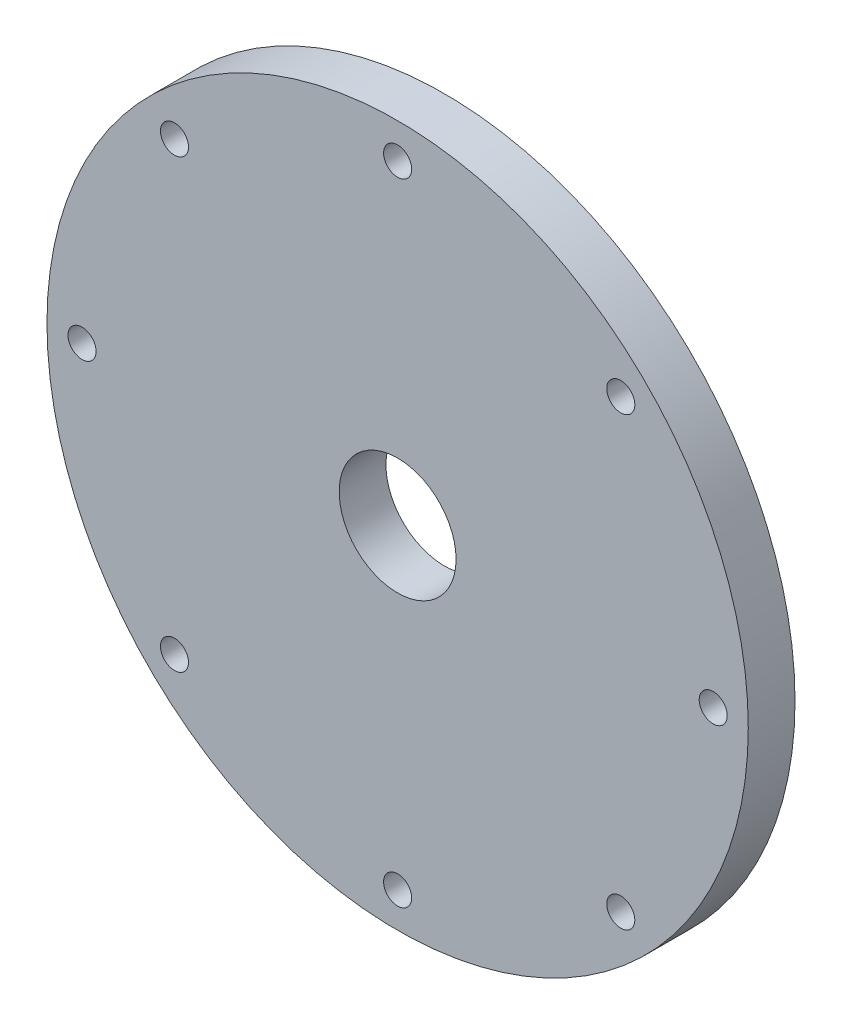
ISO-10303-21;
HEADER;
FILE_DESCRIPTION(('STEP AP214'),'2;1');
FILE_NAME('part.step','',(''),(''),'','','');
FILE_SCHEMA(('AUTOMOTIVE_DESIGN { 1 0 10303 214 1 1 1 1 }'));
ENDSEC;
DATA;
#1=APPLICATION_CONTEXT('core data for automotive mechanical design processes');
#2=APPLICATION_PROTOCOL_DEFINITION('international standard','automotive_design',2000,#1);
#3=PRODUCT_CONTEXT('',#1,'mechanical');
#4=PRODUCT('Part','Part','',(#3));
#5=PRODUCT_RELATED_PRODUCT_CATEGORY('part','',(#4));
#6=PRODUCT_DEFINITION_FORMATION('','',#4);
#7=PRODUCT_DEFINITION_CONTEXT('part definition',#1,'design');
#8=PRODUCT_DEFINITION('design','',#6,#7);
#9=PRODUCT_DEFINITION_SHAPE('','',#8);
#10=(LENGTH_UNIT() NAMED_UNIT(*) SI_UNIT(.MILLI.,.METRE.));
#11=(NAMED_UNIT(*) PLANE_ANGLE_UNIT() SI_UNIT($,.RADIAN.));
#12=(NAMED_UNIT(*) SI_UNIT($,.STERADIAN.) SOLID_ANGLE_UNIT());
#13=UNCERTAINTY_MEASURE_WITH_UNIT(LENGTH_MEASURE(1.E-05),#10,'distance_accuracy_value','');
#14=(GEOMETRIC_REPRESENTATION_CONTEXT(3) GLOBAL_UNCERTAINTY_ASSIGNED_CONTEXT((#13)) GLOBAL_UNIT_ASSIGNED_CONTEXT((#10,
#11,#12)) REPRESENTATION_CONTEXT('',''));
#15=CARTESIAN_POINT('',(0.,0.,0.));
#16=DIRECTION('',(0.,0.,1.));
#17=DIRECTION('',(1.,0.,0.));
#18=AXIS2_PLACEMENT_3D('',#15,#16,#17);
#19=CARTESIAN_POINT('',(0.,0.,10.));
#20=DIRECTION('',(0.,0.,1.));
#21=DIRECTION('',(1.,0.,0.));
#22=AXIS2_PLACEMENT_3D('',#19,#20,#21);
#23=PLANE('',#22);
#24=CARTESIAN_POINT('',(-67.5,7.07024971115735E-13,10.));
#25=DIRECTION('',(0.,0.,1.));
#26=DIRECTION('',(1.,0.,0.));
#27=AXIS2_PLACEMENT_3D('',#24,#25,#26);
#28=CIRCLE('',#27,3.);
#29=CARTESIAN_POINT('',(-64.5,7.07024971115735E-13,10.));
#30=VERTEX_POINT('',#29);
#31=EDGE_CURVE('E91',#30,#30,#28,.T.);
#32=ORIENTED_EDGE('',*,*,#31,.F.);
#33=EDGE_LOOP('',(#32));
#34=FACE_BOUND('',#33,.T.);
#35=CARTESIAN_POINT('',(-4.71349980743823E-13,-67.5,10.));
#36=DIRECTION('',(0.,0.,1.));
#37=DIRECTION('',(1.,0.,0.));
#38=AXIS2_PLACEMENT_3D('',#35,#36,#37);
#39=CIRCLE('',#38,3.);
#40=CARTESIAN_POINT('',(2.99999999999953,-67.5,10.));
#41=VERTEX_POINT('',#40);
#42=EDGE_CURVE('E79',#41,#41,#39,.T.);
#43=ORIENTED_EDGE('',*,*,#42,.F.);
#44=EDGE_LOOP('',(#43));
#45=FACE_BOUND('',#44,.T.);
#46=CARTESIAN_POINT('',(67.5,-2.35674990371912E-13,10.));
#47=DIRECTION('',(0.,0.,1.));
#48=DIRECTION('',(1.,0.,0.));
#49=AXIS2_PLACEMENT_3D('',#46,#47,#48);
#50=CIRCLE('',#49,3.);
#51=CARTESIAN_POINT('',(70.5,-2.35674990371912E-13,10.));
#52=VERTEX_POINT('',#51);
#53=EDGE_CURVE('E67',#52,#52,#50,.T.);
#54=ORIENTED_EDGE('',*,*,#53,.F.);
#55=EDGE_LOOP('',(#54));
#56=FACE_BOUND('',#55,.T.);
#57=CARTESIAN_POINT('',(0.,0.,10.));
#58=DIRECTION('',(0.,0.,1.));
#59=DIRECTION('',(1.,0.,0.));
#60=AXIS2_PLACEMENT_3D('',#57,#58,#59);
#61=CIRCLE('',#60,12.5);
#62=CARTESIAN_POINT('',(12.5,0.,10.));
#63=VERTEX_POINT('',#62);
#64=EDGE_CURVE('E55',#63,#63,#61,.T.);
#65=ORIENTED_EDGE('',*,*,#64,.F.);
#66=EDGE_LOOP('',(#65));
#67=FACE_BOUND('',#66,.T.);
#68=CARTESIAN_POINT('',(0.,0.,10.));
#69=DIRECTION('',(0.,0.,1.));
#70=DIRECTION('',(1.,0.,0.));
#71=AXIS2_PLACEMENT_3D('',#68,#69,#70);
#72=CIRCLE('',#71,75.);
#73=CARTESIAN_POINT('',(75.,0.,10.));
#74=VERTEX_POINT('',#73);
#75=EDGE_CURVE('E10',#74,#74,#72,.T.);
#76=ORIENTED_EDGE('',*,*,#75,.T.);
#77=EDGE_LOOP('',(#76));
#78=FACE_BOUND('',#77,.T.);
#79=CARTESIAN_POINT('',(0.,67.5,10.));
#80=DIRECTION('',(0.,0.,1.));
#81=DIRECTION('',(1.,0.,0.));
#82=AXIS2_PLACEMENT_3D('',#79,#80,#81);
#83=CIRCLE('',#82,3.);
#84=CARTESIAN_POINT('',(3.,67.5,10.));
#85=VERTEX_POINT('',#84);
#86=EDGE_CURVE('E50',#85,#85,#83,.T.);
#87=ORIENTED_EDGE('',*,*,#86,.F.);
#88=EDGE_LOOP('',(#87));
#89=FACE_BOUND('',#88,.T.);
#90=CARTESIAN_POINT('',(47.7297077300921,47.7297077300919,10.));
#91=DIRECTION('',(0.,0.,1.));
#92=DIRECTION('',(1.,0.,0.));
#93=AXIS2_PLACEMENT_3D('',#90,#91,#92);
#94=CIRCLE('',#93,3.);
#95=CARTESIAN_POINT('',(50.7297077300921,47.7297077300919,10.));
#96=VERTEX_POINT('',#95);
#97=EDGE_CURVE('E61',#96,#96,#94,.T.);
#98=ORIENTED_EDGE('',*,*,#97,.F.);
#99=EDGE_LOOP('',(#98));
#100=FACE_BOUND('',#99,.T.);
#101=CARTESIAN_POINT('',(47.7297077300917,-47.7297077300922,10.));
#102=DIRECTION('',(0.,0.,1.));
#103=DIRECTION('',(1.,0.,0.));
#104=AXIS2_PLACEMENT_3D('',#101,#102,#103);
#105=CIRCLE('',#104,3.);
#106=CARTESIAN_POINT('',(50.7297077300917,-47.7297077300922,10.));
#107=VERTEX_POINT('',#106);
#108=EDGE_CURVE('E73',#107,#107,#105,.T.);
#109=ORIENTED_EDGE('',*,*,#108,.F.);
#110=EDGE_LOOP('',(#109));
#111=FACE_BOUND('',#110,.T.);
#112=CARTESIAN_POINT('',(-47.7297077300924,-47.7297077300915,10.));
#113=DIRECTION('',(0.,0.,1.));
#114=DIRECTION('',(1.,0.,0.));
#115=AXIS2_PLACEMENT_3D('',#112,#113,#114);
#116=CIRCLE('',#115,3.);
#117=CARTESIAN_POINT('',(-44.7297077300924,-47.7297077300915,10.));
#118=VERTEX_POINT('',#117);
#119=EDGE_CURVE('E85',#118,#118,#116,.T.);
#120=ORIENTED_EDGE('',*,*,#119,.F.);
#121=EDGE_LOOP('',(#120));
#122=FACE_BOUND('',#121,.T.);
#123=CARTESIAN_POINT('',(-47.7297077300914,47.7297077300925,10.));
#124=DIRECTION('',(0.,0.,1.));
#125=DIRECTION('',(1.,0.,0.));
#126=AXIS2_PLACEMENT_3D('',#123,#124,#125);
#127=CIRCLE('',#126,3.);
#128=CARTESIAN_POINT('',(-44.7297077300914,47.7297077300925,10.));
#129=VERTEX_POINT('',#128);
#130=EDGE_CURVE('E97',#129,#129,#127,.T.);
#131=ORIENTED_EDGE('',*,*,#130,.F.);
#132=EDGE_LOOP('',(#131));
#133=FACE_BOUND('',#132,.T.);
#134=ADVANCED_FACE('F39',(#34,#45,#56,#67,#78,#89,#100,#111,#122,#133),#23,.T.);
#135=CARTESIAN_POINT('',(0.,0.,0.));
#136=DIRECTION('',(0.,0.,1.));
#137=DIRECTION('',(1.,0.,0.));
#138=AXIS2_PLACEMENT_3D('',#135,#136,#137);
#139=PLANE('',#138);
#140=CARTESIAN_POINT('',(0.,0.,0.));
#141=DIRECTION('',(0.,0.,1.));
#142=DIRECTION('',(1.,0.,0.));
#143=AXIS2_PLACEMENT_3D('',#140,#141,#142);
#144=CIRCLE('',#143,75.);
#145=CARTESIAN_POINT('',(75.,0.,0.));
#146=VERTEX_POINT('',#145);
#147=EDGE_CURVE('E43',#146,#146,#144,.T.);
#148=ORIENTED_EDGE('',*,*,#147,.F.);
#149=EDGE_LOOP('',(#148));
#150=FACE_BOUND('',#149,.T.);
#151=CARTESIAN_POINT('',(0.,67.5,0.));
#152=DIRECTION('',(0.,0.,1.));
#153=DIRECTION('',(1.,0.,0.));
#154=AXIS2_PLACEMENT_3D('',#151,#152,#153);
#155=CIRCLE('',#154,3.);
#156=CARTESIAN_POINT('',(3.,67.5,0.));
#157=VERTEX_POINT('',#156);
#158=EDGE_CURVE('E52',#157,#157,#155,.T.);
#159=ORIENTED_EDGE('',*,*,#158,.T.);
#160=EDGE_LOOP('',(#159));
#161=FACE_BOUND('',#160,.T.);
#162=CARTESIAN_POINT('',(0.,0.,0.));
#163=DIRECTION('',(0.,0.,1.));
#164=DIRECTION('',(1.,0.,0.));
#165=AXIS2_PLACEMENT_3D('',#162,#163,#164);
#166=CIRCLE('',#165,12.5);
#167=CARTESIAN_POINT('',(12.5,0.,0.));
#168=VERTEX_POINT('',#167);
#169=EDGE_CURVE('E58',#168,#168,#166,.T.);
#170=ORIENTED_EDGE('',*,*,#169,.T.);
#171=EDGE_LOOP('',(#170));
#172=FACE_BOUND('',#171,.T.);
#173=CARTESIAN_POINT('',(47.7297077300921,47.7297077300919,0.));
#174=DIRECTION('',(0.,0.,1.));
#175=DIRECTION('',(1.,0.,0.));
#176=AXIS2_PLACEMENT_3D('',#173,#174,#175);
#177=CIRCLE('',#176,3.);
#178=CARTESIAN_POINT('',(50.7297077300921,47.7297077300919,0.));
#179=VERTEX_POINT('',#178);
#180=EDGE_CURVE('E64',#179,#179,#177,.T.);
#181=ORIENTED_EDGE('',*,*,#180,.T.);
#182=EDGE_LOOP('',(#181));
#183=FACE_BOUND('',#182,.T.);
#184=CARTESIAN_POINT('',(67.5,-2.35674990371912E-13,0.));
#185=DIRECTION('',(0.,0.,1.));
#186=DIRECTION('',(1.,0.,0.));
#187=AXIS2_PLACEMENT_3D('',#184,#185,#186);
#188=CIRCLE('',#187,3.);
#189=CARTESIAN_POINT('',(70.5,-2.35674990371912E-13,0.));
#190=VERTEX_POINT('',#189);
#191=EDGE_CURVE('E70',#190,#190,#188,.T.);
#192=ORIENTED_EDGE('',*,*,#191,.T.);
#193=EDGE_LOOP('',(#192));
#194=FACE_BOUND('',#193,.T.);
#195=CARTESIAN_POINT('',(47.7297077300917,-47.7297077300922,0.));
#196=DIRECTION('',(0.,0.,1.));
#197=DIRECTION('',(1.,0.,0.));
#198=AXIS2_PLACEMENT_3D('',#195,#196,#197);
#199=CIRCLE('',#198,3.);
#200=CARTESIAN_POINT('',(50.7297077300917,-47.7297077300922,0.));
#201=VERTEX_POINT('',#200);
#202=EDGE_CURVE('E76',#201,#201,#199,.T.);
#203=ORIENTED_EDGE('',*,*,#202,.T.);
#204=EDGE_LOOP('',(#203));
#205=FACE_BOUND('',#204,.T.);
#206=CARTESIAN_POINT('',(-4.71349980743823E-13,-67.5,0.));
#207=DIRECTION('',(0.,0.,1.));
#208=DIRECTION('',(1.,0.,0.));
#209=AXIS2_PLACEMENT_3D('',#206,#207,#208);
#210=CIRCLE('',#209,3.);
#211=CARTESIAN_POINT('',(2.99999999999953,-67.5,0.));
#212=VERTEX_POINT('',#211);
#213=EDGE_CURVE('E82',#212,#212,#210,.T.);
#214=ORIENTED_EDGE('',*,*,#213,.T.);
#215=EDGE_LOOP('',(#214));
#216=FACE_BOUND('',#215,.T.);
#217=CARTESIAN_POINT('',(-47.7297077300924,-47.7297077300915,0.));
#218=DIRECTION('',(0.,0.,1.));
#219=DIRECTION('',(1.,0.,0.));
#220=AXIS2_PLACEMENT_3D('',#217,#218,#219);
#221=CIRCLE('',#220,3.);
#222=CARTESIAN_POINT('',(-44.7297077300924,-47.7297077300915,0.));
#223=VERTEX_POINT('',#222);
#224=EDGE_CURVE('E88',#223,#223,#221,.T.);
#225=ORIENTED_EDGE('',*,*,#224,.T.);
#226=EDGE_LOOP('',(#225));
#227=FACE_BOUND('',#226,.T.);
#228=CARTESIAN_POINT('',(-67.5,7.07024971115735E-13,0.));
#229=DIRECTION('',(0.,0.,1.));
#230=DIRECTION('',(1.,0.,0.));
#231=AXIS2_PLACEMENT_3D('',#228,#229,#230);
#232=CIRCLE('',#231,3.);
#233=CARTESIAN_POINT('',(-64.5,7.07024971115735E-13,0.));
#234=VERTEX_POINT('',#233);
#235=EDGE_CURVE('E94',#234,#234,#232,.T.);
#236=ORIENTED_EDGE('',*,*,#235,.T.);
#237=EDGE_LOOP('',(#236));
#238=FACE_BOUND('',#237,.T.);
#239=CARTESIAN_POINT('',(-47.7297077300914,47.7297077300925,0.));
#240=DIRECTION('',(0.,0.,1.));
#241=DIRECTION('',(1.,0.,0.));
#242=AXIS2_PLACEMENT_3D('',#239,#240,#241);
#243=CIRCLE('',#242,3.);
#244=CARTESIAN_POINT('',(-44.7297077300914,47.7297077300925,0.));
#245=VERTEX_POINT('',#244);
#246=EDGE_CURVE('E100',#245,#245,#243,.T.);
#247=ORIENTED_EDGE('',*,*,#246,.T.);
#248=EDGE_LOOP('',(#247));
#249=FACE_BOUND('',#248,.T.);
#250=ADVANCED_FACE('F110',(#150,#161,#172,#183,#194,#205,#216,#227,#238,#249),#139,.F.);
#251=CARTESIAN_POINT('',(0.,0.,10.));
#252=DIRECTION('',(0.,0.,-1.));
#253=DIRECTION('',(-1.,0.,0.));
#254=AXIS2_PLACEMENT_3D('',#251,#252,#253);
#255=CYLINDRICAL_SURFACE('',#254,75.);
#256=ORIENTED_EDGE('',*,*,#75,.F.);
#257=EDGE_LOOP('',(#256));
#258=FACE_BOUND('',#257,.T.);
#259=ORIENTED_EDGE('',*,*,#147,.T.);
#260=EDGE_LOOP('',(#259));
#261=FACE_BOUND('',#260,.T.);
#262=ADVANCED_FACE('F41',(#258,#261),#255,.T.);
#263=CARTESIAN_POINT('',(0.,67.5,10.));
#264=DIRECTION('',(0.,0.,-1.));
#265=DIRECTION('',(-1.,0.,0.));
#266=AXIS2_PLACEMENT_3D('',#263,#264,#265);
#267=CYLINDRICAL_SURFACE('',#266,3.);
#268=ORIENTED_EDGE('',*,*,#86,.T.);
#269=EDGE_LOOP('',(#268));
#270=FACE_BOUND('',#269,.T.);
#271=ORIENTED_EDGE('',*,*,#158,.F.);
#272=EDGE_LOOP('',(#271));
#273=FACE_BOUND('',#272,.T.);
#274=ADVANCED_FACE('F120',(#270,#273),#267,.F.);
#275=CARTESIAN_POINT('',(0.,0.,10.));
#276=DIRECTION('',(0.,0.,-1.));
#277=DIRECTION('',(-1.,0.,0.));
#278=AXIS2_PLACEMENT_3D('',#275,#276,#277);
#279=CYLINDRICAL_SURFACE('',#278,12.5);
#280=ORIENTED_EDGE('',*,*,#64,.T.);
#281=EDGE_LOOP('',(#280));
#282=FACE_BOUND('',#281,.T.);
#283=ORIENTED_EDGE('',*,*,#169,.F.);
#284=EDGE_LOOP('',(#283));
#285=FACE_BOUND('',#284,.T.);
#286=ADVANCED_FACE('F123',(#282,#285),#279,.F.);
#287=CARTESIAN_POINT('',(47.7297077300921,47.7297077300919,10.));
#288=DIRECTION('',(0.,0.,-1.));
#289=DIRECTION('',(-1.,0.,0.));
#290=AXIS2_PLACEMENT_3D('',#287,#288,#289);
#291=CYLINDRICAL_SURFACE('',#290,3.);
#292=ORIENTED_EDGE('',*,*,#97,.T.);
#293=EDGE_LOOP('',(#292));
#294=FACE_BOUND('',#293,.T.);
#295=ORIENTED_EDGE('',*,*,#180,.F.);
#296=EDGE_LOOP('',(#295));
#297=FACE_BOUND('',#296,.T.);
#298=ADVANCED_FACE('F127',(#294,#297),#291,.F.);
#299=CARTESIAN_POINT('',(67.5,-2.35674990371912E-13,10.));
#300=DIRECTION('',(0.,0.,-1.));
#301=DIRECTION('',(-1.,0.,0.));
#302=AXIS2_PLACEMENT_3D('',#299,#300,#301);
#303=CYLINDRICAL_SURFACE('',#302,3.);
#304=ORIENTED_EDGE('',*,*,#53,.T.);
#305=EDGE_LOOP('',(#304));
#306=FACE_BOUND('',#305,.T.);
#307=ORIENTED_EDGE('',*,*,#191,.F.);
#308=EDGE_LOOP('',(#307));
#309=FACE_BOUND('',#308,.T.);
#310=ADVANCED_FACE('F131',(#306,#309),#303,.F.);
#311=CARTESIAN_POINT('',(47.7297077300917,-47.7297077300922,10.));
#312=DIRECTION('',(0.,0.,-1.));
#313=DIRECTION('',(-1.,0.,0.));
#314=AXIS2_PLACEMENT_3D('',#311,#312,#313);
#315=CYLINDRICAL_SURFACE('',#314,3.);
#316=ORIENTED_EDGE('',*,*,#108,.T.);
#317=EDGE_LOOP('',(#316));
#318=FACE_BOUND('',#317,.T.);
#319=ORIENTED_EDGE('',*,*,#202,.F.);
#320=EDGE_LOOP('',(#319));
#321=FACE_BOUND('',#320,.T.);
#322=ADVANCED_FACE('F135',(#318,#321),#315,.F.);
#323=CARTESIAN_POINT('',(-4.71349980743823E-13,-67.5,10.));
#324=DIRECTION('',(0.,0.,-1.));
#325=DIRECTION('',(-1.,0.,0.));
#326=AXIS2_PLACEMENT_3D('',#323,#324,#325);
#327=CYLINDRICAL_SURFACE('',#326,3.);
#328=ORIENTED_EDGE('',*,*,#42,.T.);
#329=EDGE_LOOP('',(#328));
#330=FACE_BOUND('',#329,.T.);
#331=ORIENTED_EDGE('',*,*,#213,.F.);
#332=EDGE_LOOP('',(#331));
#333=FACE_BOUND('',#332,.T.);
#334=ADVANCED_FACE('F139',(#330,#333),#327,.F.);
#335=CARTESIAN_POINT('',(-47.7297077300924,-47.7297077300915,10.));
#336=DIRECTION('',(0.,0.,-1.));
#337=DIRECTION('',(-1.,0.,0.));
#338=AXIS2_PLACEMENT_3D('',#335,#336,#337);
#339=CYLINDRICAL_SURFACE('',#338,3.);
#340=ORIENTED_EDGE('',*,*,#119,.T.);
#341=EDGE_LOOP('',(#340));
#342=FACE_BOUND('',#341,.T.);
#343=ORIENTED_EDGE('',*,*,#224,.F.);
#344=EDGE_LOOP('',(#343));
#345=FACE_BOUND('',#344,.T.);
#346=ADVANCED_FACE('F143',(#342,#345),#339,.F.);
#347=CARTESIAN_POINT('',(-67.5,7.07024971115735E-13,10.));
#348=DIRECTION('',(0.,0.,-1.));
#349=DIRECTION('',(-1.,0.,0.));
#350=AXIS2_PLACEMENT_3D('',#347,#348,#349);
#351=CYLINDRICAL_SURFACE('',#350,3.);
#352=ORIENTED_EDGE('',*,*,#31,.T.);
#353=EDGE_LOOP('',(#352));
#354=FACE_BOUND('',#353,.T.);
#355=ORIENTED_EDGE('',*,*,#235,.F.);
#356=EDGE_LOOP('',(#355));
#357=FACE_BOUND('',#356,.T.);
#358=ADVANCED_FACE('F147',(#354,#357),#351,.F.);
#359=CARTESIAN_POINT('',(-47.7297077300914,47.7297077300925,10.));
#360=DIRECTION('',(0.,0.,-1.));
#361=DIRECTION('',(-1.,0.,0.));
#362=AXIS2_PLACEMENT_3D('',#359,#360,#361);
#363=CYLINDRICAL_SURFACE('',#362,3.);
#364=ORIENTED_EDGE('',*,*,#130,.T.);
#365=EDGE_LOOP('',(#364));
#366=FACE_BOUND('',#365,.T.);
#367=ORIENTED_EDGE('',*,*,#246,.F.);
#368=EDGE_LOOP('',(#367));
#369=FACE_BOUND('',#368,.T.);
#370=ADVANCED_FACE('F106',(#366,#369),#363,.F.);
#371=CLOSED_SHELL('',(#134,#250,#262,#274,#286,#298,#310,#322,#334,#346,#358,#370));
#372=MANIFOLD_SOLID_BREP('B2',#371);
#373=ADVANCED_BREP_SHAPE_REPRESENTATION('',(#18,#372),#14);
#374=SHAPE_DEFINITION_REPRESENTATION(#9,#373);
ENDSEC;
END-ISO-10303-21;
